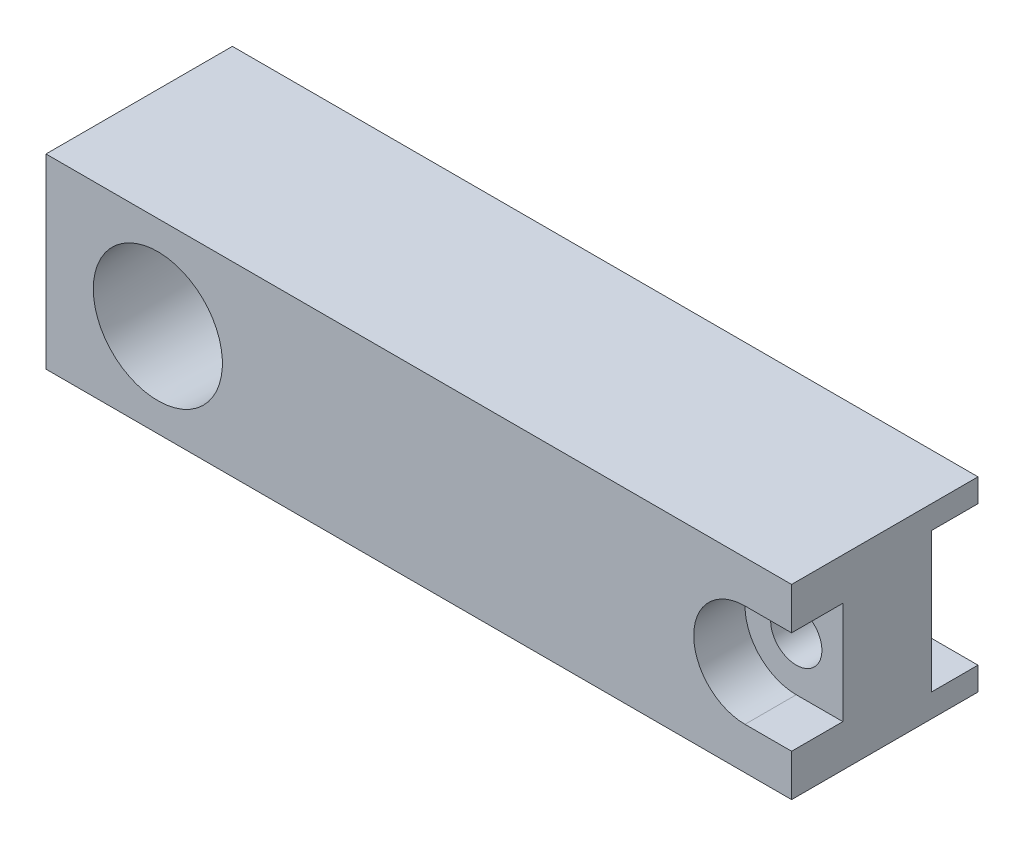
ISO-10303-21;
HEADER;
FILE_DESCRIPTION(('STEP AP214'),'2;1');
FILE_NAME('part.step','',(''),(''),'','','');
FILE_SCHEMA(('AUTOMOTIVE_DESIGN { 1 0 10303 214 1 1 1 1 }'));
ENDSEC;
DATA;
#1=APPLICATION_CONTEXT('core data for automotive mechanical design processes');
#2=APPLICATION_PROTOCOL_DEFINITION('international standard','automotive_design',2000,#1);
#3=PRODUCT_CONTEXT('',#1,'mechanical');
#4=PRODUCT('Part','Part','',(#3));
#5=PRODUCT_RELATED_PRODUCT_CATEGORY('part','',(#4));
#6=PRODUCT_DEFINITION_FORMATION('','',#4);
#7=PRODUCT_DEFINITION_CONTEXT('part definition',#1,'design');
#8=PRODUCT_DEFINITION('design','',#6,#7);
#9=PRODUCT_DEFINITION_SHAPE('','',#8);
#10=(LENGTH_UNIT() NAMED_UNIT(*) SI_UNIT(.MILLI.,.METRE.));
#11=(NAMED_UNIT(*) PLANE_ANGLE_UNIT() SI_UNIT($,.RADIAN.));
#12=(NAMED_UNIT(*) SI_UNIT($,.STERADIAN.) SOLID_ANGLE_UNIT());
#13=UNCERTAINTY_MEASURE_WITH_UNIT(LENGTH_MEASURE(1.E-05),#10,'distance_accuracy_value','');
#14=(GEOMETRIC_REPRESENTATION_CONTEXT(3) GLOBAL_UNCERTAINTY_ASSIGNED_CONTEXT((#13)) GLOBAL_UNIT_ASSIGNED_CONTEXT((#10,
#11,#12)) REPRESENTATION_CONTEXT('',''));
#15=CARTESIAN_POINT('',(0.,0.,0.));
#16=DIRECTION('',(0.,0.,1.));
#17=DIRECTION('',(1.,0.,0.));
#18=AXIS2_PLACEMENT_3D('',#15,#16,#17);
#19=CARTESIAN_POINT('',(63.,0.,7.77817459305203));
#20=DIRECTION('',(0.,0.,-1.));
#21=DIRECTION('',(-1.,0.,0.));
#22=AXIS2_PLACEMENT_3D('',#19,#20,#21);
#23=CYLINDRICAL_SURFACE('',#22,2.75);
#24=CARTESIAN_POINT('',(63.,0.,-15.));
#25=DIRECTION('',(0.,0.,-1.));
#26=DIRECTION('',(-1.,0.,0.));
#27=AXIS2_PLACEMENT_3D('',#24,#25,#26);
#28=CIRCLE('',#27,2.75);
#29=CARTESIAN_POINT('',(60.25,0.,-15.));
#30=VERTEX_POINT('',#29);
#31=EDGE_CURVE('E177',#30,#30,#28,.T.);
#32=ORIENTED_EDGE('',*,*,#31,.T.);
#33=EDGE_LOOP('',(#32));
#34=FACE_BOUND('',#33,.T.);
#35=CARTESIAN_POINT('',(63.,0.,-5.5));
#36=DIRECTION('',(0.,0.,1.));
#37=DIRECTION('',(1.,0.,0.));
#38=AXIS2_PLACEMENT_3D('',#35,#36,#37);
#39=CIRCLE('',#38,2.75);
#40=CARTESIAN_POINT('',(65.75,0.,-5.5));
#41=VERTEX_POINT('',#40);
#42=EDGE_CURVE('E50',#41,#41,#39,.F.);
#43=ORIENTED_EDGE('',*,*,#42,.F.);
#44=EDGE_LOOP('',(#43));
#45=FACE_BOUND('',#44,.T.);
#46=ADVANCED_FACE('F46',(#34,#45),#23,.F.);
#47=CARTESIAN_POINT('',(-12.,10.,-20.));
#48=DIRECTION('',(0.,-1.,0.));
#49=DIRECTION('',(0.,0.,-1.));
#50=AXIS2_PLACEMENT_3D('',#47,#48,#49);
#51=PLANE('',#50);
#52=DIRECTION('',(0.,0.,-1.));
#53=VECTOR('',#52,1.);
#54=CARTESIAN_POINT('',(68.,10.,0.));
#55=LINE('',#54,#53);
#56=CARTESIAN_POINT('',(68.,10.,0.));
#57=VERTEX_POINT('',#56);
#58=CARTESIAN_POINT('',(68.,10.,-20.));
#59=VERTEX_POINT('',#58);
#60=EDGE_CURVE('E184',#57,#59,#55,.T.);
#61=ORIENTED_EDGE('',*,*,#60,.T.);
#62=DIRECTION('',(1.,0.,0.));
#63=VECTOR('',#62,1.);
#64=CARTESIAN_POINT('',(-12.,10.,-20.));
#65=LINE('',#64,#63);
#66=CARTESIAN_POINT('',(-12.,10.,-20.));
#67=VERTEX_POINT('',#66);
#68=EDGE_CURVE('E234',#67,#59,#65,.T.);
#69=ORIENTED_EDGE('',*,*,#68,.F.);
#70=DIRECTION('',(0.,0.,1.));
#71=VECTOR('',#70,1.);
#72=CARTESIAN_POINT('',(-12.,10.,-20.));
#73=LINE('',#72,#71);
#74=CARTESIAN_POINT('',(-12.,10.,0.));
#75=VERTEX_POINT('',#74);
#76=EDGE_CURVE('E11',#67,#75,#73,.T.);
#77=ORIENTED_EDGE('',*,*,#76,.T.);
#78=DIRECTION('',(1.,0.,0.));
#79=VECTOR('',#78,1.);
#80=CARTESIAN_POINT('',(-12.,10.,0.));
#81=LINE('',#80,#79);
#82=EDGE_CURVE('E228',#75,#57,#81,.T.);
#83=ORIENTED_EDGE('',*,*,#82,.T.);
#84=EDGE_LOOP('',(#61,#69,#77,#83));
#85=FACE_BOUND('',#84,.T.);
#86=ADVANCED_FACE('F244',(#85),#51,.F.);
#87=CARTESIAN_POINT('',(83.,-10.,-20.));
#88=DIRECTION('',(0.,1.,0.));
#89=DIRECTION('',(1.,0.,0.));
#90=AXIS2_PLACEMENT_3D('',#87,#88,#89);
#91=PLANE('',#90);
#92=DIRECTION('',(0.,0.,1.));
#93=VECTOR('',#92,1.);
#94=CARTESIAN_POINT('',(67.9999999999999,-10.,0.));
#95=LINE('',#94,#93);
#96=CARTESIAN_POINT('',(67.9999999999999,-10.,-20.));
#97=VERTEX_POINT('',#96);
#98=CARTESIAN_POINT('',(67.9999999999999,-10.,0.));
#99=VERTEX_POINT('',#98);
#100=EDGE_CURVE('E191',#97,#99,#95,.T.);
#101=ORIENTED_EDGE('',*,*,#100,.T.);
#102=DIRECTION('',(-1.,0.,0.));
#103=VECTOR('',#102,1.);
#104=CARTESIAN_POINT('',(83.,-10.,0.));
#105=LINE('',#104,#103);
#106=CARTESIAN_POINT('',(-12.,-10.,0.));
#107=VERTEX_POINT('',#106);
#108=EDGE_CURVE('E231',#99,#107,#105,.T.);
#109=ORIENTED_EDGE('',*,*,#108,.T.);
#110=DIRECTION('',(0.,0.,1.));
#111=VECTOR('',#110,1.);
#112=CARTESIAN_POINT('',(-12.,-10.,-20.));
#113=LINE('',#112,#111);
#114=CARTESIAN_POINT('',(-12.,-10.,-20.));
#115=VERTEX_POINT('',#114);
#116=EDGE_CURVE('E55',#115,#107,#113,.T.);
#117=ORIENTED_EDGE('',*,*,#116,.F.);
#118=DIRECTION('',(-1.,0.,0.));
#119=VECTOR('',#118,1.);
#120=CARTESIAN_POINT('',(83.,-10.,-20.));
#121=LINE('',#120,#119);
#122=EDGE_CURVE('E216',#97,#115,#121,.T.);
#123=ORIENTED_EDGE('',*,*,#122,.F.);
#124=EDGE_LOOP('',(#101,#109,#117,#123));
#125=FACE_BOUND('',#124,.T.);
#126=ADVANCED_FACE('F274',(#125),#91,.F.);
#127=CARTESIAN_POINT('',(-12.,-10.,0.));
#128=DIRECTION('',(0.,0.,-1.));
#129=DIRECTION('',(0.,-1.,0.));
#130=AXIS2_PLACEMENT_3D('',#127,#128,#129);
#131=PLANE('',#130);
#132=CARTESIAN_POINT('',(0.,0.,0.));
#133=DIRECTION('',(0.,0.,-1.));
#134=DIRECTION('',(-1.,0.,0.));
#135=AXIS2_PLACEMENT_3D('',#132,#133,#134);
#136=CIRCLE('',#135,6.92584167948768);
#137=CARTESIAN_POINT('',(-6.92584167948768,0.,0.));
#138=VERTEX_POINT('',#137);
#139=EDGE_CURVE('E223',#138,#138,#136,.T.);
#140=ORIENTED_EDGE('',*,*,#139,.T.);
#141=EDGE_LOOP('',(#140));
#142=FACE_BOUND('',#141,.T.);
#143=CARTESIAN_POINT('',(63.,0.,0.));
#144=DIRECTION('',(0.,0.,1.));
#145=DIRECTION('',(1.,0.,0.));
#146=AXIS2_PLACEMENT_3D('',#143,#144,#145);
#147=CIRCLE('',#146,5.5);
#148=CARTESIAN_POINT('',(63.,5.5,0.));
#149=VERTEX_POINT('',#148);
#150=CARTESIAN_POINT('',(63.,-5.5,0.));
#151=VERTEX_POINT('',#150);
#152=EDGE_CURVE('E148',#149,#151,#147,.T.);
#153=ORIENTED_EDGE('',*,*,#152,.F.);
#154=DIRECTION('',(-1.,0.,0.));
#155=VECTOR('',#154,1.);
#156=CARTESIAN_POINT('',(63.,5.5,0.));
#157=LINE('',#156,#155);
#158=CARTESIAN_POINT('',(68.,5.5,0.));
#159=VERTEX_POINT('',#158);
#160=EDGE_CURVE('E162',#159,#149,#157,.T.);
#161=ORIENTED_EDGE('',*,*,#160,.F.);
#162=DIRECTION('',(0.,1.,0.));
#163=VECTOR('',#162,1.);
#164=CARTESIAN_POINT('',(68.,9.99999999999979,0.));
#165=LINE('',#164,#163);
#166=EDGE_CURVE('E187',#159,#57,#165,.T.);
#167=ORIENTED_EDGE('',*,*,#166,.T.);
#168=ORIENTED_EDGE('',*,*,#82,.F.);
#169=DIRECTION('',(0.,1.,0.));
#170=VECTOR('',#169,1.);
#171=CARTESIAN_POINT('',(-12.,-10.,0.));
#172=LINE('',#171,#170);
#173=EDGE_CURVE('E225',#107,#75,#172,.T.);
#174=ORIENTED_EDGE('',*,*,#173,.F.);
#175=ORIENTED_EDGE('',*,*,#108,.F.);
#176=CARTESIAN_POINT('',(67.9999999999999,-5.5,0.));
#177=VERTEX_POINT('',#176);
#178=EDGE_CURVE('E188',#99,#177,#165,.T.);
#179=ORIENTED_EDGE('',*,*,#178,.T.);
#180=DIRECTION('',(1.,0.,0.));
#181=VECTOR('',#180,1.);
#182=CARTESIAN_POINT('',(63.,-5.5,0.));
#183=LINE('',#182,#181);
#184=EDGE_CURVE('E165',#151,#177,#183,.T.);
#185=ORIENTED_EDGE('',*,*,#184,.F.);
#186=EDGE_LOOP('',(#153,#161,#167,#168,#174,#175,#179,#185));
#187=FACE_BOUND('',#186,.T.);
#188=ADVANCED_FACE('F249',(#142,#187),#131,.F.);
#189=CARTESIAN_POINT('',(-12.,-10.,-20.));
#190=DIRECTION('',(0.,0.,-1.));
#191=DIRECTION('',(0.,-1.,0.));
#192=AXIS2_PLACEMENT_3D('',#189,#190,#191);
#193=PLANE('',#192);
#194=CARTESIAN_POINT('',(0.,0.,-20.));
#195=DIRECTION('',(0.,0.,-1.));
#196=DIRECTION('',(-1.,0.,0.));
#197=AXIS2_PLACEMENT_3D('',#194,#195,#196);
#198=CIRCLE('',#197,7.925);
#199=CARTESIAN_POINT('',(-7.925,0.,-20.));
#200=VERTEX_POINT('',#199);
#201=EDGE_CURVE('E232',#200,#200,#198,.T.);
#202=ORIENTED_EDGE('',*,*,#201,.F.);
#203=EDGE_LOOP('',(#202));
#204=FACE_BOUND('',#203,.T.);
#205=ORIENTED_EDGE('',*,*,#68,.T.);
#206=DIRECTION('',(0.,-1.,0.));
#207=VECTOR('',#206,1.);
#208=CARTESIAN_POINT('',(68.,9.99999999999979,-20.));
#209=LINE('',#208,#207);
#210=CARTESIAN_POINT('',(68.,7.5,-20.));
#211=VERTEX_POINT('',#210);
#212=EDGE_CURVE('E181',#59,#211,#209,.T.);
#213=ORIENTED_EDGE('',*,*,#212,.T.);
#214=DIRECTION('',(1.,0.,0.));
#215=VECTOR('',#214,1.);
#216=CARTESIAN_POINT('',(68.,7.5,-20.));
#217=LINE('',#216,#215);
#218=CARTESIAN_POINT('',(63.0250628144669,7.5,-20.));
#219=VERTEX_POINT('',#218);
#220=EDGE_CURVE('E209',#219,#211,#217,.T.);
#221=ORIENTED_EDGE('',*,*,#220,.F.);
#222=CARTESIAN_POINT('',(68.,0.,-20.));
#223=DIRECTION('',(0.,0.,-1.));
#224=DIRECTION('',(-1.,0.,0.));
#225=AXIS2_PLACEMENT_3D('',#222,#223,#224);
#226=CIRCLE('',#225,9.);
#227=CARTESIAN_POINT('',(63.0250628144669,-7.5,-20.));
#228=VERTEX_POINT('',#227);
#229=EDGE_CURVE('E71',#228,#219,#226,.T.);
#230=ORIENTED_EDGE('',*,*,#229,.F.);
#231=DIRECTION('',(-1.,0.,0.));
#232=VECTOR('',#231,1.);
#233=CARTESIAN_POINT('',(67.9999999999999,-7.5,-20.));
#234=LINE('',#233,#232);
#235=CARTESIAN_POINT('',(67.9999999999999,-7.5,-20.));
#236=VERTEX_POINT('',#235);
#237=EDGE_CURVE('E198',#236,#228,#234,.T.);
#238=ORIENTED_EDGE('',*,*,#237,.F.);
#239=EDGE_CURVE('E180',#236,#97,#209,.T.);
#240=ORIENTED_EDGE('',*,*,#239,.T.);
#241=ORIENTED_EDGE('',*,*,#122,.T.);
#242=DIRECTION('',(0.,1.,0.));
#243=VECTOR('',#242,1.);
#244=CARTESIAN_POINT('',(-12.,-10.,-20.));
#245=LINE('',#244,#243);
#246=EDGE_CURVE('E237',#115,#67,#245,.T.);
#247=ORIENTED_EDGE('',*,*,#246,.T.);
#248=EDGE_LOOP('',(#205,#213,#221,#230,#238,#240,#241,#247));
#249=FACE_BOUND('',#248,.T.);
#250=ADVANCED_FACE('F48',(#204,#249),#193,.T.);
#251=CARTESIAN_POINT('',(0.,0.,0.));
#252=DIRECTION('',(0.,0.,-1.));
#253=DIRECTION('',(-1.,0.,0.));
#254=AXIS2_PLACEMENT_3D('',#251,#252,#253);
#255=CONICAL_SURFACE('',#254,6.92584167948768,0.0499164165500011);
#256=ORIENTED_EDGE('',*,*,#139,.F.);
#257=EDGE_LOOP('',(#256));
#258=FACE_BOUND('',#257,.T.);
#259=ORIENTED_EDGE('',*,*,#201,.T.);
#260=EDGE_LOOP('',(#259));
#261=FACE_BOUND('',#260,.T.);
#262=ADVANCED_FACE('F279',(#258,#261),#255,.F.);
#263=CARTESIAN_POINT('',(-12.,-10.,-20.));
#264=DIRECTION('',(1.,0.,0.));
#265=DIRECTION('',(0.,1.,0.));
#266=AXIS2_PLACEMENT_3D('',#263,#264,#265);
#267=PLANE('',#266);
#268=ORIENTED_EDGE('',*,*,#173,.T.);
#269=ORIENTED_EDGE('',*,*,#76,.F.);
#270=ORIENTED_EDGE('',*,*,#246,.F.);
#271=ORIENTED_EDGE('',*,*,#116,.T.);
#272=EDGE_LOOP('',(#268,#269,#270,#271));
#273=FACE_BOUND('',#272,.T.);
#274=ADVANCED_FACE('F277',(#273),#267,.F.);
#275=CARTESIAN_POINT('',(68.,0.,-15.));
#276=DIRECTION('',(0.,0.,-1.));
#277=DIRECTION('',(-1.,0.,0.));
#278=AXIS2_PLACEMENT_3D('',#275,#276,#277);
#279=CYLINDRICAL_SURFACE('',#278,9.);
#280=ORIENTED_EDGE('',*,*,#229,.T.);
#281=DIRECTION('',(0.,0.,-1.));
#282=VECTOR('',#281,1.);
#283=CARTESIAN_POINT('',(63.0250628144669,7.5,-15.));
#284=LINE('',#283,#282);
#285=CARTESIAN_POINT('',(63.0250628144669,7.5,-15.));
#286=VERTEX_POINT('',#285);
#287=EDGE_CURVE('E207',#286,#219,#284,.T.);
#288=ORIENTED_EDGE('',*,*,#287,.F.);
#289=CARTESIAN_POINT('',(68.,0.,-15.));
#290=DIRECTION('',(0.,0.,-1.));
#291=DIRECTION('',(-1.,0.,0.));
#292=AXIS2_PLACEMENT_3D('',#289,#290,#291);
#293=CIRCLE('',#292,9.);
#294=CARTESIAN_POINT('',(63.0250628144669,-7.5,-15.));
#295=VERTEX_POINT('',#294);
#296=EDGE_CURVE('E194',#295,#286,#293,.T.);
#297=ORIENTED_EDGE('',*,*,#296,.F.);
#298=DIRECTION('',(0.,0.,-1.));
#299=VECTOR('',#298,1.);
#300=CARTESIAN_POINT('',(63.0250628144669,-7.5,-15.));
#301=LINE('',#300,#299);
#302=EDGE_CURVE('E214',#295,#228,#301,.T.);
#303=ORIENTED_EDGE('',*,*,#302,.T.);
#304=EDGE_LOOP('',(#280,#288,#297,#303));
#305=FACE_BOUND('',#304,.T.);
#306=ADVANCED_FACE('F263',(#305),#279,.F.);
#307=CARTESIAN_POINT('',(67.9999999999999,-7.5,-15.));
#308=DIRECTION('',(0.,-1.,0.));
#309=DIRECTION('',(0.,0.,-1.));
#310=AXIS2_PLACEMENT_3D('',#307,#308,#309);
#311=PLANE('',#310);
#312=ORIENTED_EDGE('',*,*,#237,.T.);
#313=ORIENTED_EDGE('',*,*,#302,.F.);
#314=DIRECTION('',(-1.,0.,0.));
#315=VECTOR('',#314,1.);
#316=CARTESIAN_POINT('',(67.9999999999999,-7.5,-15.));
#317=LINE('',#316,#315);
#318=CARTESIAN_POINT('',(67.9999999999999,-7.5,-15.));
#319=VERTEX_POINT('',#318);
#320=EDGE_CURVE('E204',#319,#295,#317,.T.);
#321=ORIENTED_EDGE('',*,*,#320,.F.);
#322=DIRECTION('',(0.,0.,-1.));
#323=VECTOR('',#322,1.);
#324=CARTESIAN_POINT('',(67.9999999999999,-7.5,-15.));
#325=LINE('',#324,#323);
#326=EDGE_CURVE('E217',#319,#236,#325,.T.);
#327=ORIENTED_EDGE('',*,*,#326,.T.);
#328=EDGE_LOOP('',(#312,#313,#321,#327));
#329=FACE_BOUND('',#328,.T.);
#330=ADVANCED_FACE('F268',(#329),#311,.F.);
#331=CARTESIAN_POINT('',(68.,7.5,-15.));
#332=DIRECTION('',(0.,1.,0.));
#333=DIRECTION('',(0.,0.,1.));
#334=AXIS2_PLACEMENT_3D('',#331,#332,#333);
#335=PLANE('',#334);
#336=ORIENTED_EDGE('',*,*,#220,.T.);
#337=DIRECTION('',(0.,0.,-1.));
#338=VECTOR('',#337,1.);
#339=CARTESIAN_POINT('',(68.,7.5,-15.));
#340=LINE('',#339,#338);
#341=CARTESIAN_POINT('',(68.0000000000001,7.5,-15.));
#342=VERTEX_POINT('',#341);
#343=EDGE_CURVE('E220',#342,#211,#340,.T.);
#344=ORIENTED_EDGE('',*,*,#343,.F.);
#345=DIRECTION('',(1.,0.,0.));
#346=VECTOR('',#345,1.);
#347=CARTESIAN_POINT('',(68.,7.5,-15.));
#348=LINE('',#347,#346);
#349=EDGE_CURVE('E197',#286,#342,#348,.T.);
#350=ORIENTED_EDGE('',*,*,#349,.F.);
#351=ORIENTED_EDGE('',*,*,#287,.T.);
#352=EDGE_LOOP('',(#336,#344,#350,#351));
#353=FACE_BOUND('',#352,.T.);
#354=ADVANCED_FACE('F260',(#353),#335,.F.);
#355=CARTESIAN_POINT('',(68.,0.,-15.));
#356=DIRECTION('',(0.,0.,-1.));
#357=DIRECTION('',(-1.,0.,0.));
#358=AXIS2_PLACEMENT_3D('',#355,#356,#357);
#359=PLANE('',#358);
#360=ORIENTED_EDGE('',*,*,#31,.F.);
#361=EDGE_LOOP('',(#360));
#362=FACE_BOUND('',#361,.T.);
#363=ORIENTED_EDGE('',*,*,#296,.T.);
#364=ORIENTED_EDGE('',*,*,#349,.T.);
#365=DIRECTION('',(0.,-1.,0.));
#366=VECTOR('',#365,1.);
#367=CARTESIAN_POINT('',(67.9999999999999,-7.5,-15.));
#368=LINE('',#367,#366);
#369=EDGE_CURVE('E201',#342,#319,#368,.T.);
#370=ORIENTED_EDGE('',*,*,#369,.T.);
#371=ORIENTED_EDGE('',*,*,#320,.T.);
#372=EDGE_LOOP('',(#363,#364,#370,#371));
#373=FACE_BOUND('',#372,.T.);
#374=ADVANCED_FACE('F266',(#362,#373),#359,.T.);
#375=CARTESIAN_POINT('',(67.9999999999999,-7.5,-15.));
#376=DIRECTION('',(1.,0.,0.));
#377=DIRECTION('',(0.,1.,0.));
#378=AXIS2_PLACEMENT_3D('',#375,#376,#377);
#379=PLANE('',#378);
#380=DIRECTION('',(0.,0.,1.));
#381=VECTOR('',#380,1.);
#382=CARTESIAN_POINT('',(68.,5.5,-5.5));
#383=LINE('',#382,#381);
#384=CARTESIAN_POINT('',(68.,5.5,-5.5));
#385=VERTEX_POINT('',#384);
#386=EDGE_CURVE('E174',#385,#159,#383,.T.);
#387=ORIENTED_EDGE('',*,*,#386,.F.);
#388=DIRECTION('',(0.,1.,0.));
#389=VECTOR('',#388,1.);
#390=CARTESIAN_POINT('',(67.9999999999999,-5.5,-5.5));
#391=LINE('',#390,#389);
#392=CARTESIAN_POINT('',(67.9999999999999,-5.5,-5.5));
#393=VERTEX_POINT('',#392);
#394=EDGE_CURVE('E157',#393,#385,#391,.T.);
#395=ORIENTED_EDGE('',*,*,#394,.F.);
#396=DIRECTION('',(0.,0.,1.));
#397=VECTOR('',#396,1.);
#398=CARTESIAN_POINT('',(67.9999999999999,-5.5,-5.5));
#399=LINE('',#398,#397);
#400=EDGE_CURVE('E151',#393,#177,#399,.T.);
#401=ORIENTED_EDGE('',*,*,#400,.T.);
#402=ORIENTED_EDGE('',*,*,#178,.F.);
#403=ORIENTED_EDGE('',*,*,#100,.F.);
#404=ORIENTED_EDGE('',*,*,#239,.F.);
#405=ORIENTED_EDGE('',*,*,#326,.F.);
#406=ORIENTED_EDGE('',*,*,#369,.F.);
#407=ORIENTED_EDGE('',*,*,#343,.T.);
#408=ORIENTED_EDGE('',*,*,#212,.F.);
#409=ORIENTED_EDGE('',*,*,#60,.F.);
#410=ORIENTED_EDGE('',*,*,#166,.F.);
#411=EDGE_LOOP('',(#387,#395,#401,#402,#403,#404,#405,#406,#407,#408,#409,#410));
#412=FACE_BOUND('',#411,.T.);
#413=ADVANCED_FACE('F255',(#412),#379,.T.);
#414=CARTESIAN_POINT('',(63.,0.,-5.5));
#415=DIRECTION('',(0.,0.,1.));
#416=DIRECTION('',(1.,0.,0.));
#417=AXIS2_PLACEMENT_3D('',#414,#415,#416);
#418=PLANE('',#417);
#419=CARTESIAN_POINT('',(63.,0.,-5.5));
#420=DIRECTION('',(0.,0.,1.));
#421=DIRECTION('',(1.,0.,0.));
#422=AXIS2_PLACEMENT_3D('',#419,#420,#421);
#423=CIRCLE('',#422,5.5);
#424=CARTESIAN_POINT('',(63.,5.5,-5.5));
#425=VERTEX_POINT('',#424);
#426=CARTESIAN_POINT('',(63.,-5.5,-5.5));
#427=VERTEX_POINT('',#426);
#428=EDGE_CURVE('E145',#425,#427,#423,.T.);
#429=ORIENTED_EDGE('',*,*,#428,.T.);
#430=DIRECTION('',(1.,0.,0.));
#431=VECTOR('',#430,1.);
#432=CARTESIAN_POINT('',(63.,-5.5,-5.5));
#433=LINE('',#432,#431);
#434=EDGE_CURVE('E63',#427,#393,#433,.T.);
#435=ORIENTED_EDGE('',*,*,#434,.T.);
#436=ORIENTED_EDGE('',*,*,#394,.T.);
#437=DIRECTION('',(-1.,0.,0.));
#438=VECTOR('',#437,1.);
#439=CARTESIAN_POINT('',(63.,5.5,-5.5));
#440=LINE('',#439,#438);
#441=EDGE_CURVE('E152',#385,#425,#440,.T.);
#442=ORIENTED_EDGE('',*,*,#441,.T.);
#443=EDGE_LOOP('',(#429,#435,#436,#442));
#444=FACE_BOUND('',#443,.T.);
#445=ORIENTED_EDGE('',*,*,#42,.T.);
#446=EDGE_LOOP('',(#445));
#447=FACE_BOUND('',#446,.T.);
#448=ADVANCED_FACE('F159',(#444,#447),#418,.T.);
#449=CARTESIAN_POINT('',(63.,0.,-5.5));
#450=DIRECTION('',(0.,0.,1.));
#451=DIRECTION('',(1.,0.,0.));
#452=AXIS2_PLACEMENT_3D('',#449,#450,#451);
#453=CYLINDRICAL_SURFACE('',#452,5.5);
#454=ORIENTED_EDGE('',*,*,#152,.T.);
#455=DIRECTION('',(0.,0.,1.));
#456=VECTOR('',#455,1.);
#457=CARTESIAN_POINT('',(63.,-5.5,-5.5));
#458=LINE('',#457,#456);
#459=EDGE_CURVE('E143',#427,#151,#458,.T.);
#460=ORIENTED_EDGE('',*,*,#459,.F.);
#461=ORIENTED_EDGE('',*,*,#428,.F.);
#462=DIRECTION('',(0.,0.,1.));
#463=VECTOR('',#462,1.);
#464=CARTESIAN_POINT('',(63.,5.5,-5.5));
#465=LINE('',#464,#463);
#466=EDGE_CURVE('E172',#425,#149,#465,.T.);
#467=ORIENTED_EDGE('',*,*,#466,.T.);
#468=EDGE_LOOP('',(#454,#460,#461,#467));
#469=FACE_BOUND('',#468,.T.);
#470=ADVANCED_FACE('F144',(#469),#453,.F.);
#471=CARTESIAN_POINT('',(63.,5.5,-5.5));
#472=DIRECTION('',(0.,1.,0.));
#473=DIRECTION('',(0.,0.,1.));
#474=AXIS2_PLACEMENT_3D('',#471,#472,#473);
#475=PLANE('',#474);
#476=ORIENTED_EDGE('',*,*,#160,.T.);
#477=ORIENTED_EDGE('',*,*,#466,.F.);
#478=ORIENTED_EDGE('',*,*,#441,.F.);
#479=ORIENTED_EDGE('',*,*,#386,.T.);
#480=EDGE_LOOP('',(#476,#477,#478,#479));
#481=FACE_BOUND('',#480,.T.);
#482=ADVANCED_FACE('F331',(#481),#475,.F.);
#483=CARTESIAN_POINT('',(63.,-5.5,-5.5));
#484=DIRECTION('',(0.,-1.,0.));
#485=DIRECTION('',(0.,0.,-1.));
#486=AXIS2_PLACEMENT_3D('',#483,#484,#485);
#487=PLANE('',#486);
#488=ORIENTED_EDGE('',*,*,#184,.T.);
#489=ORIENTED_EDGE('',*,*,#400,.F.);
#490=ORIENTED_EDGE('',*,*,#434,.F.);
#491=ORIENTED_EDGE('',*,*,#459,.T.);
#492=EDGE_LOOP('',(#488,#489,#490,#491));
#493=FACE_BOUND('',#492,.T.);
#494=ADVANCED_FACE('F154',(#493),#487,.F.);
#495=CLOSED_SHELL('',(#46,#86,#126,#188,#250,#262,#274,#306,#330,#354,#374,#413,#448,#470,#482,#494));
#496=MANIFOLD_SOLID_BREP('B2',#495);
#497=ADVANCED_BREP_SHAPE_REPRESENTATION('',(#18,#496),#14);
#498=SHAPE_DEFINITION_REPRESENTATION(#9,#497);
ENDSEC;
END-ISO-10303-21;
